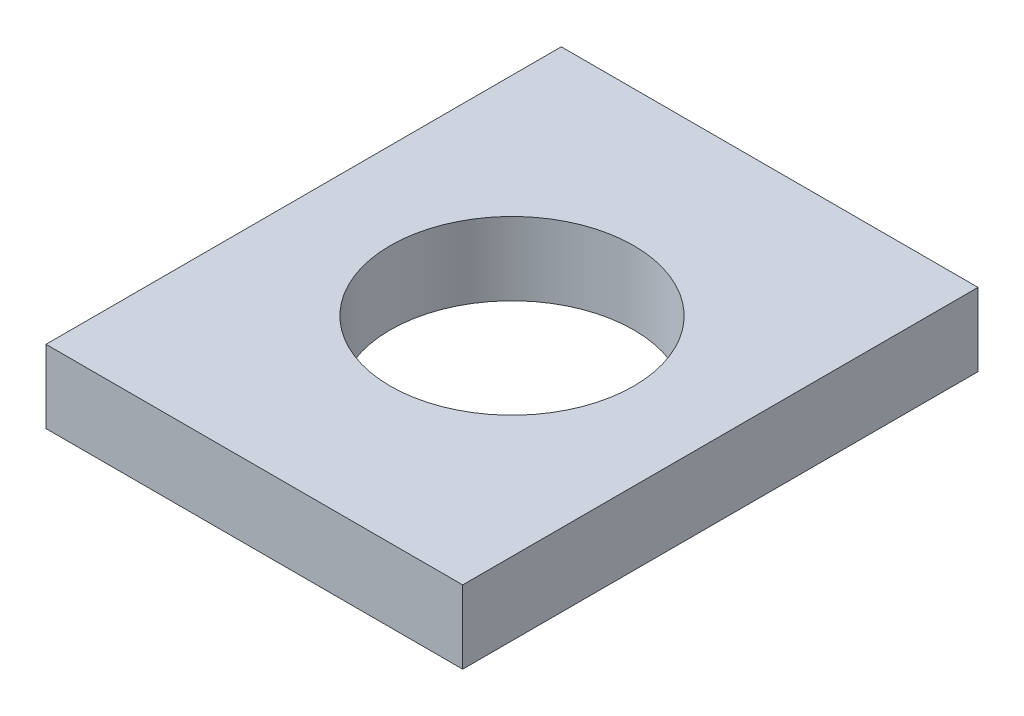
ISO-10303-21;
HEADER;
FILE_DESCRIPTION(('STEP AP214'),'2;1');
FILE_NAME('part.step','',(''),(''),'','','');
FILE_SCHEMA(('AUTOMOTIVE_DESIGN { 1 0 10303 214 1 1 1 1 }'));
ENDSEC;
DATA;
#1=APPLICATION_CONTEXT('core data for automotive mechanical design processes');
#2=APPLICATION_PROTOCOL_DEFINITION('international standard','automotive_design',2000,#1);
#3=PRODUCT_CONTEXT('',#1,'mechanical');
#4=PRODUCT('Part','Part','',(#3));
#5=PRODUCT_RELATED_PRODUCT_CATEGORY('part','',(#4));
#6=PRODUCT_DEFINITION_FORMATION('','',#4);
#7=PRODUCT_DEFINITION_CONTEXT('part definition',#1,'design');
#8=PRODUCT_DEFINITION('design','',#6,#7);
#9=PRODUCT_DEFINITION_SHAPE('','',#8);
#10=(LENGTH_UNIT() NAMED_UNIT(*) SI_UNIT(.MILLI.,.METRE.));
#11=(NAMED_UNIT(*) PLANE_ANGLE_UNIT() SI_UNIT($,.RADIAN.));
#12=(NAMED_UNIT(*) SI_UNIT($,.STERADIAN.) SOLID_ANGLE_UNIT());
#13=UNCERTAINTY_MEASURE_WITH_UNIT(LENGTH_MEASURE(1.E-05),#10,'distance_accuracy_value','');
#14=(GEOMETRIC_REPRESENTATION_CONTEXT(3) GLOBAL_UNCERTAINTY_ASSIGNED_CONTEXT((#13)) GLOBAL_UNIT_ASSIGNED_CONTEXT((#10,
#11,#12)) REPRESENTATION_CONTEXT('',''));
#15=CARTESIAN_POINT('',(0.,0.,0.));
#16=DIRECTION('',(0.,0.,1.));
#17=DIRECTION('',(1.,0.,0.));
#18=AXIS2_PLACEMENT_3D('',#15,#16,#17);
#19=CARTESIAN_POINT('',(-51.35,18.,-63.5));
#20=DIRECTION('',(1.,0.,0.));
#21=DIRECTION('',(0.,0.,-1.));
#22=AXIS2_PLACEMENT_3D('',#19,#20,#21);
#23=PLANE('',#22);
#24=DIRECTION('',(0.,0.,1.));
#25=VECTOR('',#24,1.);
#26=CARTESIAN_POINT('',(-51.35,0.,-63.5));
#27=LINE('',#26,#25);
#28=CARTESIAN_POINT('',(-51.35,0.,-63.5));
#29=VERTEX_POINT('',#28);
#30=CARTESIAN_POINT('',(-51.35,0.,63.5));
#31=VERTEX_POINT('',#30);
#32=EDGE_CURVE('E96',#29,#31,#27,.T.);
#33=ORIENTED_EDGE('',*,*,#32,.T.);
#34=DIRECTION('',(0.,-1.,0.));
#35=VECTOR('',#34,1.);
#36=CARTESIAN_POINT('',(-51.35,18.,63.5));
#37=LINE('',#36,#35);
#38=CARTESIAN_POINT('',(-51.35,18.,63.5));
#39=VERTEX_POINT('',#38);
#40=EDGE_CURVE('E11',#39,#31,#37,.T.);
#41=ORIENTED_EDGE('',*,*,#40,.F.);
#42=DIRECTION('',(0.,0.,1.));
#43=VECTOR('',#42,1.);
#44=CARTESIAN_POINT('',(-51.35,18.,-63.5));
#45=LINE('',#44,#43);
#46=CARTESIAN_POINT('',(-51.35,18.,-63.5));
#47=VERTEX_POINT('',#46);
#48=EDGE_CURVE('E84',#47,#39,#45,.T.);
#49=ORIENTED_EDGE('',*,*,#48,.F.);
#50=DIRECTION('',(0.,-1.,0.));
#51=VECTOR('',#50,1.);
#52=CARTESIAN_POINT('',(-51.35,18.,-63.5));
#53=LINE('',#52,#51);
#54=EDGE_CURVE('E92',#47,#29,#53,.T.);
#55=ORIENTED_EDGE('',*,*,#54,.T.);
#56=EDGE_LOOP('',(#33,#41,#49,#55));
#57=FACE_BOUND('',#56,.T.);
#58=ADVANCED_FACE('F33',(#57),#23,.F.);
#59=CARTESIAN_POINT('',(51.35,18.,63.5));
#60=DIRECTION('',(0.,0.,-1.));
#61=DIRECTION('',(-1.,0.,0.));
#62=AXIS2_PLACEMENT_3D('',#59,#60,#61);
#63=PLANE('',#62);
#64=DIRECTION('',(1.,0.,0.));
#65=VECTOR('',#64,1.);
#66=CARTESIAN_POINT('',(51.35,0.,63.5));
#67=LINE('',#66,#65);
#68=CARTESIAN_POINT('',(51.35,0.,63.5));
#69=VERTEX_POINT('',#68);
#70=EDGE_CURVE('E88',#31,#69,#67,.T.);
#71=ORIENTED_EDGE('',*,*,#70,.T.);
#72=DIRECTION('',(0.,-1.,0.));
#73=VECTOR('',#72,1.);
#74=CARTESIAN_POINT('',(51.35,18.,63.5));
#75=LINE('',#74,#73);
#76=CARTESIAN_POINT('',(51.35,18.,63.5));
#77=VERTEX_POINT('',#76);
#78=EDGE_CURVE('E41',#77,#69,#75,.T.);
#79=ORIENTED_EDGE('',*,*,#78,.F.);
#80=DIRECTION('',(1.,0.,0.));
#81=VECTOR('',#80,1.);
#82=CARTESIAN_POINT('',(51.35,18.,63.5));
#83=LINE('',#82,#81);
#84=EDGE_CURVE('E79',#39,#77,#83,.T.);
#85=ORIENTED_EDGE('',*,*,#84,.F.);
#86=ORIENTED_EDGE('',*,*,#40,.T.);
#87=EDGE_LOOP('',(#71,#79,#85,#86));
#88=FACE_BOUND('',#87,.T.);
#89=ADVANCED_FACE('F87',(#88),#63,.F.);
#90=CARTESIAN_POINT('',(51.35,18.,-63.5));
#91=DIRECTION('',(-1.,0.,0.));
#92=DIRECTION('',(0.,0.,1.));
#93=AXIS2_PLACEMENT_3D('',#90,#91,#92);
#94=PLANE('',#93);
#95=DIRECTION('',(0.,0.,-1.));
#96=VECTOR('',#95,1.);
#97=CARTESIAN_POINT('',(51.35,0.,-63.5));
#98=LINE('',#97,#96);
#99=CARTESIAN_POINT('',(51.35,0.,-63.5));
#100=VERTEX_POINT('',#99);
#101=EDGE_CURVE('E66',#69,#100,#98,.T.);
#102=ORIENTED_EDGE('',*,*,#101,.T.);
#103=DIRECTION('',(0.,-1.,0.));
#104=VECTOR('',#103,1.);
#105=CARTESIAN_POINT('',(51.35,18.,-63.5));
#106=LINE('',#105,#104);
#107=CARTESIAN_POINT('',(51.35,18.,-63.5));
#108=VERTEX_POINT('',#107);
#109=EDGE_CURVE('E89',#108,#100,#106,.T.);
#110=ORIENTED_EDGE('',*,*,#109,.F.);
#111=DIRECTION('',(0.,0.,-1.));
#112=VECTOR('',#111,1.);
#113=CARTESIAN_POINT('',(51.35,18.,-63.5));
#114=LINE('',#113,#112);
#115=EDGE_CURVE('E82',#77,#108,#114,.T.);
#116=ORIENTED_EDGE('',*,*,#115,.F.);
#117=ORIENTED_EDGE('',*,*,#78,.T.);
#118=EDGE_LOOP('',(#102,#110,#116,#117));
#119=FACE_BOUND('',#118,.T.);
#120=ADVANCED_FACE('F90',(#119),#94,.F.);
#121=CARTESIAN_POINT('',(51.35,18.,-63.5));
#122=DIRECTION('',(0.,0.,1.));
#123=DIRECTION('',(1.,0.,0.));
#124=AXIS2_PLACEMENT_3D('',#121,#122,#123);
#125=PLANE('',#124);
#126=DIRECTION('',(-1.,0.,0.));
#127=VECTOR('',#126,1.);
#128=CARTESIAN_POINT('',(51.35,0.,-63.5));
#129=LINE('',#128,#127);
#130=EDGE_CURVE('E72',#100,#29,#129,.T.);
#131=ORIENTED_EDGE('',*,*,#130,.T.);
#132=ORIENTED_EDGE('',*,*,#54,.F.);
#133=DIRECTION('',(-1.,0.,0.));
#134=VECTOR('',#133,1.);
#135=CARTESIAN_POINT('',(51.35,18.,-63.5));
#136=LINE('',#135,#134);
#137=EDGE_CURVE('E49',#108,#47,#136,.T.);
#138=ORIENTED_EDGE('',*,*,#137,.F.);
#139=ORIENTED_EDGE('',*,*,#109,.T.);
#140=EDGE_LOOP('',(#131,#132,#138,#139));
#141=FACE_BOUND('',#140,.T.);
#142=ADVANCED_FACE('F104',(#141),#125,.F.);
#143=CARTESIAN_POINT('',(0.,18.,0.));
#144=DIRECTION('',(0.,-1.,0.));
#145=DIRECTION('',(0.,0.,-1.));
#146=AXIS2_PLACEMENT_3D('',#143,#144,#145);
#147=PLANE('',#146);
#148=CARTESIAN_POINT('',(0.,18.,0.));
#149=DIRECTION('',(0.,1.,0.));
#150=DIRECTION('',(0.,0.,1.));
#151=AXIS2_PLACEMENT_3D('',#148,#149,#150);
#152=CIRCLE('',#151,30.);
#153=CARTESIAN_POINT('',(0.,18.,30.));
#154=VERTEX_POINT('',#153);
#155=EDGE_CURVE('E110',#154,#154,#152,.T.);
#156=ORIENTED_EDGE('',*,*,#155,.F.);
#157=EDGE_LOOP('',(#156));
#158=FACE_BOUND('',#157,.T.);
#159=ORIENTED_EDGE('',*,*,#48,.T.);
#160=ORIENTED_EDGE('',*,*,#84,.T.);
#161=ORIENTED_EDGE('',*,*,#115,.T.);
#162=ORIENTED_EDGE('',*,*,#137,.T.);
#163=EDGE_LOOP('',(#159,#160,#161,#162));
#164=FACE_BOUND('',#163,.T.);
#165=ADVANCED_FACE('F80',(#158,#164),#147,.F.);
#166=CARTESIAN_POINT('',(0.,0.,0.));
#167=DIRECTION('',(0.,-1.,0.));
#168=DIRECTION('',(0.,0.,-1.));
#169=AXIS2_PLACEMENT_3D('',#166,#167,#168);
#170=PLANE('',#169);
#171=CARTESIAN_POINT('',(0.,0.,0.));
#172=DIRECTION('',(0.,1.,0.));
#173=DIRECTION('',(0.,0.,1.));
#174=AXIS2_PLACEMENT_3D('',#171,#172,#173);
#175=CIRCLE('',#174,30.);
#176=CARTESIAN_POINT('',(0.,0.,30.));
#177=VERTEX_POINT('',#176);
#178=EDGE_CURVE('E99',#177,#177,#175,.T.);
#179=ORIENTED_EDGE('',*,*,#178,.T.);
#180=EDGE_LOOP('',(#179));
#181=FACE_BOUND('',#180,.T.);
#182=ORIENTED_EDGE('',*,*,#32,.F.);
#183=ORIENTED_EDGE('',*,*,#130,.F.);
#184=ORIENTED_EDGE('',*,*,#101,.F.);
#185=ORIENTED_EDGE('',*,*,#70,.F.);
#186=EDGE_LOOP('',(#182,#183,#184,#185));
#187=FACE_BOUND('',#186,.T.);
#188=ADVANCED_FACE('F107',(#181,#187),#170,.T.);
#189=CARTESIAN_POINT('',(0.,0.,0.));
#190=DIRECTION('',(0.,1.,0.));
#191=DIRECTION('',(0.,0.,1.));
#192=AXIS2_PLACEMENT_3D('',#189,#190,#191);
#193=CYLINDRICAL_SURFACE('',#192,30.);
#194=ORIENTED_EDGE('',*,*,#178,.F.);
#195=EDGE_LOOP('',(#194));
#196=FACE_BOUND('',#195,.T.);
#197=ORIENTED_EDGE('',*,*,#155,.T.);
#198=EDGE_LOOP('',(#197));
#199=FACE_BOUND('',#198,.T.);
#200=ADVANCED_FACE('F117',(#196,#199),#193,.F.);
#201=CLOSED_SHELL('',(#58,#89,#120,#142,#165,#188,#200));
#202=MANIFOLD_SOLID_BREP('B2',#201);
#203=ADVANCED_BREP_SHAPE_REPRESENTATION('',(#18,#202),#14);
#204=SHAPE_DEFINITION_REPRESENTATION(#9,#203);
ENDSEC;
END-ISO-10303-21;
